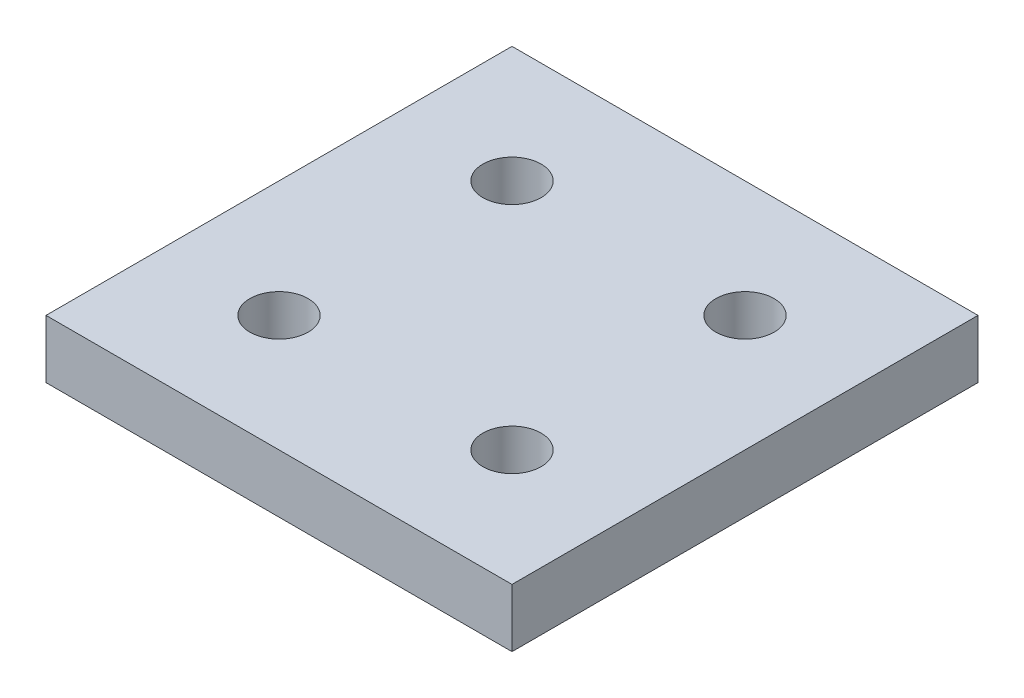
ISO-10303-21;
HEADER;
FILE_DESCRIPTION(('STEP AP214'),'2;1');
FILE_NAME('part.step','',(''),(''),'','','');
FILE_SCHEMA(('AUTOMOTIVE_DESIGN { 1 0 10303 214 1 1 1 1 }'));
ENDSEC;
DATA;
#1=APPLICATION_CONTEXT('core data for automotive mechanical design processes');
#2=APPLICATION_PROTOCOL_DEFINITION('international standard','automotive_design',2000,#1);
#3=PRODUCT_CONTEXT('',#1,'mechanical');
#4=PRODUCT('Part','Part','',(#3));
#5=PRODUCT_RELATED_PRODUCT_CATEGORY('part','',(#4));
#6=PRODUCT_DEFINITION_FORMATION('','',#4);
#7=PRODUCT_DEFINITION_CONTEXT('part definition',#1,'design');
#8=PRODUCT_DEFINITION('design','',#6,#7);
#9=PRODUCT_DEFINITION_SHAPE('','',#8);
#10=(LENGTH_UNIT() NAMED_UNIT(*) SI_UNIT(.MILLI.,.METRE.));
#11=(NAMED_UNIT(*) PLANE_ANGLE_UNIT() SI_UNIT($,.RADIAN.));
#12=(NAMED_UNIT(*) SI_UNIT($,.STERADIAN.) SOLID_ANGLE_UNIT());
#13=UNCERTAINTY_MEASURE_WITH_UNIT(LENGTH_MEASURE(1.E-05),#10,'distance_accuracy_value','');
#14=(GEOMETRIC_REPRESENTATION_CONTEXT(3) GLOBAL_UNCERTAINTY_ASSIGNED_CONTEXT((#13)) GLOBAL_UNIT_ASSIGNED_CONTEXT((#10,
#11,#12)) REPRESENTATION_CONTEXT('',''));
#15=CARTESIAN_POINT('',(0.,0.,0.));
#16=DIRECTION('',(0.,0.,1.));
#17=DIRECTION('',(1.,0.,0.));
#18=AXIS2_PLACEMENT_3D('',#15,#16,#17);
#19=CARTESIAN_POINT('',(0.,12.7,0.));
#20=DIRECTION('',(1.,0.,0.));
#21=DIRECTION('',(0.,0.,-1.));
#22=AXIS2_PLACEMENT_3D('',#19,#20,#21);
#23=PLANE('',#22);
#24=DIRECTION('',(0.,0.,1.));
#25=VECTOR('',#24,1.);
#26=CARTESIAN_POINT('',(0.,0.,0.));
#27=LINE('',#26,#25);
#28=CARTESIAN_POINT('',(0.,0.,-101.6));
#29=VERTEX_POINT('',#28);
#30=CARTESIAN_POINT('',(0.,0.,0.));
#31=VERTEX_POINT('',#30);
#32=EDGE_CURVE('E107',#29,#31,#27,.T.);
#33=ORIENTED_EDGE('',*,*,#32,.T.);
#34=DIRECTION('',(0.,-1.,0.));
#35=VECTOR('',#34,1.);
#36=CARTESIAN_POINT('',(0.,12.7,0.));
#37=LINE('',#36,#35);
#38=CARTESIAN_POINT('',(0.,12.7,0.));
#39=VERTEX_POINT('',#38);
#40=EDGE_CURVE('E11',#39,#31,#37,.T.);
#41=ORIENTED_EDGE('',*,*,#40,.F.);
#42=DIRECTION('',(0.,0.,1.));
#43=VECTOR('',#42,1.);
#44=CARTESIAN_POINT('',(0.,12.7,0.));
#45=LINE('',#44,#43);
#46=CARTESIAN_POINT('',(0.,12.7,-101.6));
#47=VERTEX_POINT('',#46);
#48=EDGE_CURVE('E91',#47,#39,#45,.T.);
#49=ORIENTED_EDGE('',*,*,#48,.F.);
#50=DIRECTION('',(0.,-1.,0.));
#51=VECTOR('',#50,1.);
#52=CARTESIAN_POINT('',(0.,12.7,-101.6));
#53=LINE('',#52,#51);
#54=EDGE_CURVE('E103',#47,#29,#53,.T.);
#55=ORIENTED_EDGE('',*,*,#54,.T.);
#56=EDGE_LOOP('',(#33,#41,#49,#55));
#57=FACE_BOUND('',#56,.T.);
#58=ADVANCED_FACE('F39',(#57),#23,.F.);
#59=CARTESIAN_POINT('',(0.,12.7,0.));
#60=DIRECTION('',(0.,0.,-1.));
#61=DIRECTION('',(-1.,0.,0.));
#62=AXIS2_PLACEMENT_3D('',#59,#60,#61);
#63=PLANE('',#62);
#64=DIRECTION('',(1.,0.,0.));
#65=VECTOR('',#64,1.);
#66=CARTESIAN_POINT('',(0.,0.,0.));
#67=LINE('',#66,#65);
#68=CARTESIAN_POINT('',(101.6,0.,0.));
#69=VERTEX_POINT('',#68);
#70=EDGE_CURVE('E96',#31,#69,#67,.T.);
#71=ORIENTED_EDGE('',*,*,#70,.T.);
#72=DIRECTION('',(0.,-1.,0.));
#73=VECTOR('',#72,1.);
#74=CARTESIAN_POINT('',(101.6,12.7,0.));
#75=LINE('',#74,#73);
#76=CARTESIAN_POINT('',(101.6,12.7,0.));
#77=VERTEX_POINT('',#76);
#78=EDGE_CURVE('E48',#77,#69,#75,.T.);
#79=ORIENTED_EDGE('',*,*,#78,.F.);
#80=DIRECTION('',(1.,0.,0.));
#81=VECTOR('',#80,1.);
#82=CARTESIAN_POINT('',(0.,12.7,0.));
#83=LINE('',#82,#81);
#84=EDGE_CURVE('E86',#39,#77,#83,.T.);
#85=ORIENTED_EDGE('',*,*,#84,.F.);
#86=ORIENTED_EDGE('',*,*,#40,.T.);
#87=EDGE_LOOP('',(#71,#79,#85,#86));
#88=FACE_BOUND('',#87,.T.);
#89=ADVANCED_FACE('F95',(#88),#63,.F.);
#90=CARTESIAN_POINT('',(101.6,12.7,0.));
#91=DIRECTION('',(-1.,0.,0.));
#92=DIRECTION('',(0.,0.,1.));
#93=AXIS2_PLACEMENT_3D('',#90,#91,#92);
#94=PLANE('',#93);
#95=DIRECTION('',(0.,0.,-1.));
#96=VECTOR('',#95,1.);
#97=CARTESIAN_POINT('',(101.6,0.,0.));
#98=LINE('',#97,#96);
#99=CARTESIAN_POINT('',(101.6,0.,-101.6));
#100=VERTEX_POINT('',#99);
#101=EDGE_CURVE('E73',#69,#100,#98,.T.);
#102=ORIENTED_EDGE('',*,*,#101,.T.);
#103=DIRECTION('',(0.,-1.,0.));
#104=VECTOR('',#103,1.);
#105=CARTESIAN_POINT('',(101.6,12.7,-101.6));
#106=LINE('',#105,#104);
#107=CARTESIAN_POINT('',(101.6,12.7,-101.6));
#108=VERTEX_POINT('',#107);
#109=EDGE_CURVE('E98',#108,#100,#106,.T.);
#110=ORIENTED_EDGE('',*,*,#109,.F.);
#111=DIRECTION('',(0.,0.,-1.));
#112=VECTOR('',#111,1.);
#113=CARTESIAN_POINT('',(101.6,12.7,0.));
#114=LINE('',#113,#112);
#115=EDGE_CURVE('E89',#77,#108,#114,.T.);
#116=ORIENTED_EDGE('',*,*,#115,.F.);
#117=ORIENTED_EDGE('',*,*,#78,.T.);
#118=EDGE_LOOP('',(#102,#110,#116,#117));
#119=FACE_BOUND('',#118,.T.);
#120=ADVANCED_FACE('F99',(#119),#94,.F.);
#121=CARTESIAN_POINT('',(0.,12.7,-101.6));
#122=DIRECTION('',(0.,0.,1.));
#123=DIRECTION('',(1.,0.,0.));
#124=AXIS2_PLACEMENT_3D('',#121,#122,#123);
#125=PLANE('',#124);
#126=DIRECTION('',(-1.,0.,0.));
#127=VECTOR('',#126,1.);
#128=CARTESIAN_POINT('',(0.,0.,-101.6));
#129=LINE('',#128,#127);
#130=EDGE_CURVE('E79',#100,#29,#129,.T.);
#131=ORIENTED_EDGE('',*,*,#130,.T.);
#132=ORIENTED_EDGE('',*,*,#54,.F.);
#133=DIRECTION('',(-1.,0.,0.));
#134=VECTOR('',#133,1.);
#135=CARTESIAN_POINT('',(0.,12.7,-101.6));
#136=LINE('',#135,#134);
#137=EDGE_CURVE('E56',#108,#47,#136,.T.);
#138=ORIENTED_EDGE('',*,*,#137,.F.);
#139=ORIENTED_EDGE('',*,*,#109,.T.);
#140=EDGE_LOOP('',(#131,#132,#138,#139));
#141=FACE_BOUND('',#140,.T.);
#142=ADVANCED_FACE('F121',(#141),#125,.F.);
#143=CARTESIAN_POINT('',(0.,12.7,0.));
#144=DIRECTION('',(0.,-1.,0.));
#145=DIRECTION('',(0.,0.,-1.));
#146=AXIS2_PLACEMENT_3D('',#143,#144,#145);
#147=PLANE('',#146);
#148=CARTESIAN_POINT('',(25.4,12.7,-25.4));
#149=DIRECTION('',(0.,1.,0.));
#150=DIRECTION('',(0.,0.,1.));
#151=AXIS2_PLACEMENT_3D('',#148,#149,#150);
#152=CIRCLE('',#151,6.34999999999999);
#153=CARTESIAN_POINT('',(25.4,12.7,-19.05));
#154=VERTEX_POINT('',#153);
#155=EDGE_CURVE('E155',#154,#154,#152,.T.);
#156=ORIENTED_EDGE('',*,*,#155,.F.);
#157=EDGE_LOOP('',(#156));
#158=FACE_BOUND('',#157,.T.);
#159=CARTESIAN_POINT('',(25.4,12.7,-76.2));
#160=DIRECTION('',(0.,1.,0.));
#161=DIRECTION('',(0.,0.,1.));
#162=AXIS2_PLACEMENT_3D('',#159,#160,#161);
#163=CIRCLE('',#162,6.34999999999999);
#164=CARTESIAN_POINT('',(25.4,12.7,-69.85));
#165=VERTEX_POINT('',#164);
#166=EDGE_CURVE('E147',#165,#165,#163,.T.);
#167=ORIENTED_EDGE('',*,*,#166,.F.);
#168=EDGE_LOOP('',(#167));
#169=FACE_BOUND('',#168,.T.);
#170=CARTESIAN_POINT('',(76.2,12.7,-76.2));
#171=DIRECTION('',(0.,1.,0.));
#172=DIRECTION('',(0.,0.,1.));
#173=AXIS2_PLACEMENT_3D('',#170,#171,#172);
#174=CIRCLE('',#173,6.34999999999998);
#175=CARTESIAN_POINT('',(76.2,12.7,-69.85));
#176=VERTEX_POINT('',#175);
#177=EDGE_CURVE('E139',#176,#176,#174,.T.);
#178=ORIENTED_EDGE('',*,*,#177,.F.);
#179=EDGE_LOOP('',(#178));
#180=FACE_BOUND('',#179,.T.);
#181=CARTESIAN_POINT('',(76.2,12.7,-25.4));
#182=DIRECTION('',(0.,1.,0.));
#183=DIRECTION('',(0.,0.,1.));
#184=AXIS2_PLACEMENT_3D('',#181,#182,#183);
#185=CIRCLE('',#184,6.34999999999999);
#186=CARTESIAN_POINT('',(76.2,12.7,-19.05));
#187=VERTEX_POINT('',#186);
#188=EDGE_CURVE('E131',#187,#187,#185,.T.);
#189=ORIENTED_EDGE('',*,*,#188,.F.);
#190=EDGE_LOOP('',(#189));
#191=FACE_BOUND('',#190,.T.);
#192=ORIENTED_EDGE('',*,*,#48,.T.);
#193=ORIENTED_EDGE('',*,*,#84,.T.);
#194=ORIENTED_EDGE('',*,*,#115,.T.);
#195=ORIENTED_EDGE('',*,*,#137,.T.);
#196=EDGE_LOOP('',(#192,#193,#194,#195));
#197=FACE_BOUND('',#196,.T.);
#198=ADVANCED_FACE('F87',(#158,#169,#180,#191,#197),#147,.F.);
#199=CARTESIAN_POINT('',(0.,0.,0.));
#200=DIRECTION('',(0.,-1.,0.));
#201=DIRECTION('',(0.,0.,-1.));
#202=AXIS2_PLACEMENT_3D('',#199,#200,#201);
#203=PLANE('',#202);
#204=CARTESIAN_POINT('',(25.4,0.,-25.4));
#205=DIRECTION('',(0.,1.,0.));
#206=DIRECTION('',(0.,0.,1.));
#207=AXIS2_PLACEMENT_3D('',#204,#205,#206);
#208=CIRCLE('',#207,6.34999999999999);
#209=CARTESIAN_POINT('',(25.4,0.,-19.05));
#210=VERTEX_POINT('',#209);
#211=EDGE_CURVE('E151',#210,#210,#208,.T.);
#212=ORIENTED_EDGE('',*,*,#211,.T.);
#213=EDGE_LOOP('',(#212));
#214=FACE_BOUND('',#213,.T.);
#215=CARTESIAN_POINT('',(25.4,0.,-76.2));
#216=DIRECTION('',(0.,1.,0.));
#217=DIRECTION('',(0.,0.,1.));
#218=AXIS2_PLACEMENT_3D('',#215,#216,#217);
#219=CIRCLE('',#218,6.34999999999999);
#220=CARTESIAN_POINT('',(25.4,0.,-69.85));
#221=VERTEX_POINT('',#220);
#222=EDGE_CURVE('E143',#221,#221,#219,.T.);
#223=ORIENTED_EDGE('',*,*,#222,.T.);
#224=EDGE_LOOP('',(#223));
#225=FACE_BOUND('',#224,.T.);
#226=CARTESIAN_POINT('',(76.2,0.,-76.2));
#227=DIRECTION('',(0.,1.,0.));
#228=DIRECTION('',(0.,0.,1.));
#229=AXIS2_PLACEMENT_3D('',#226,#227,#228);
#230=CIRCLE('',#229,6.34999999999998);
#231=CARTESIAN_POINT('',(76.2,0.,-69.85));
#232=VERTEX_POINT('',#231);
#233=EDGE_CURVE('E135',#232,#232,#230,.T.);
#234=ORIENTED_EDGE('',*,*,#233,.T.);
#235=EDGE_LOOP('',(#234));
#236=FACE_BOUND('',#235,.T.);
#237=CARTESIAN_POINT('',(76.2,0.,-25.4));
#238=DIRECTION('',(0.,1.,0.));
#239=DIRECTION('',(0.,0.,1.));
#240=AXIS2_PLACEMENT_3D('',#237,#238,#239);
#241=CIRCLE('',#240,6.34999999999999);
#242=CARTESIAN_POINT('',(76.2,0.,-19.05));
#243=VERTEX_POINT('',#242);
#244=EDGE_CURVE('E111',#243,#243,#241,.T.);
#245=ORIENTED_EDGE('',*,*,#244,.T.);
#246=EDGE_LOOP('',(#245));
#247=FACE_BOUND('',#246,.T.);
#248=ORIENTED_EDGE('',*,*,#32,.F.);
#249=ORIENTED_EDGE('',*,*,#130,.F.);
#250=ORIENTED_EDGE('',*,*,#101,.F.);
#251=ORIENTED_EDGE('',*,*,#70,.F.);
#252=EDGE_LOOP('',(#248,#249,#250,#251));
#253=FACE_BOUND('',#252,.T.);
#254=ADVANCED_FACE('F124',(#214,#225,#236,#247,#253),#203,.T.);
#255=CARTESIAN_POINT('',(76.2,12.7,-25.4));
#256=DIRECTION('',(0.,1.,0.));
#257=DIRECTION('',(0.,0.,1.));
#258=AXIS2_PLACEMENT_3D('',#255,#256,#257);
#259=CYLINDRICAL_SURFACE('',#258,6.34999999999999);
#260=ORIENTED_EDGE('',*,*,#244,.F.);
#261=EDGE_LOOP('',(#260));
#262=FACE_BOUND('',#261,.T.);
#263=ORIENTED_EDGE('',*,*,#188,.T.);
#264=EDGE_LOOP('',(#263));
#265=FACE_BOUND('',#264,.T.);
#266=ADVANCED_FACE('F171',(#262,#265),#259,.F.);
#267=CARTESIAN_POINT('',(76.2,12.7,-76.2));
#268=DIRECTION('',(0.,1.,0.));
#269=DIRECTION('',(0.,0.,1.));
#270=AXIS2_PLACEMENT_3D('',#267,#268,#269);
#271=CYLINDRICAL_SURFACE('',#270,6.34999999999998);
#272=ORIENTED_EDGE('',*,*,#233,.F.);
#273=EDGE_LOOP('',(#272));
#274=FACE_BOUND('',#273,.T.);
#275=ORIENTED_EDGE('',*,*,#177,.T.);
#276=EDGE_LOOP('',(#275));
#277=FACE_BOUND('',#276,.T.);
#278=ADVANCED_FACE('F173',(#274,#277),#271,.F.);
#279=CARTESIAN_POINT('',(25.4,12.7,-76.2));
#280=DIRECTION('',(0.,1.,0.));
#281=DIRECTION('',(0.,0.,1.));
#282=AXIS2_PLACEMENT_3D('',#279,#280,#281);
#283=CYLINDRICAL_SURFACE('',#282,6.34999999999999);
#284=ORIENTED_EDGE('',*,*,#222,.F.);
#285=EDGE_LOOP('',(#284));
#286=FACE_BOUND('',#285,.T.);
#287=ORIENTED_EDGE('',*,*,#166,.T.);
#288=EDGE_LOOP('',(#287));
#289=FACE_BOUND('',#288,.T.);
#290=ADVANCED_FACE('F180',(#286,#289),#283,.F.);
#291=CARTESIAN_POINT('',(25.4,12.7,-25.4));
#292=DIRECTION('',(0.,1.,0.));
#293=DIRECTION('',(0.,0.,1.));
#294=AXIS2_PLACEMENT_3D('',#291,#292,#293);
#295=CYLINDRICAL_SURFACE('',#294,6.34999999999999);
#296=ORIENTED_EDGE('',*,*,#211,.F.);
#297=EDGE_LOOP('',(#296));
#298=FACE_BOUND('',#297,.T.);
#299=ORIENTED_EDGE('',*,*,#155,.T.);
#300=EDGE_LOOP('',(#299));
#301=FACE_BOUND('',#300,.T.);
#302=ADVANCED_FACE('F160',(#298,#301),#295,.F.);
#303=CLOSED_SHELL('',(#58,#89,#120,#142,#198,#254,#266,#278,#290,#302));
#304=MANIFOLD_SOLID_BREP('B2',#303);
#305=ADVANCED_BREP_SHAPE_REPRESENTATION('',(#18,#304),#14);
#306=SHAPE_DEFINITION_REPRESENTATION(#9,#305);
ENDSEC;
END-ISO-10303-21;
